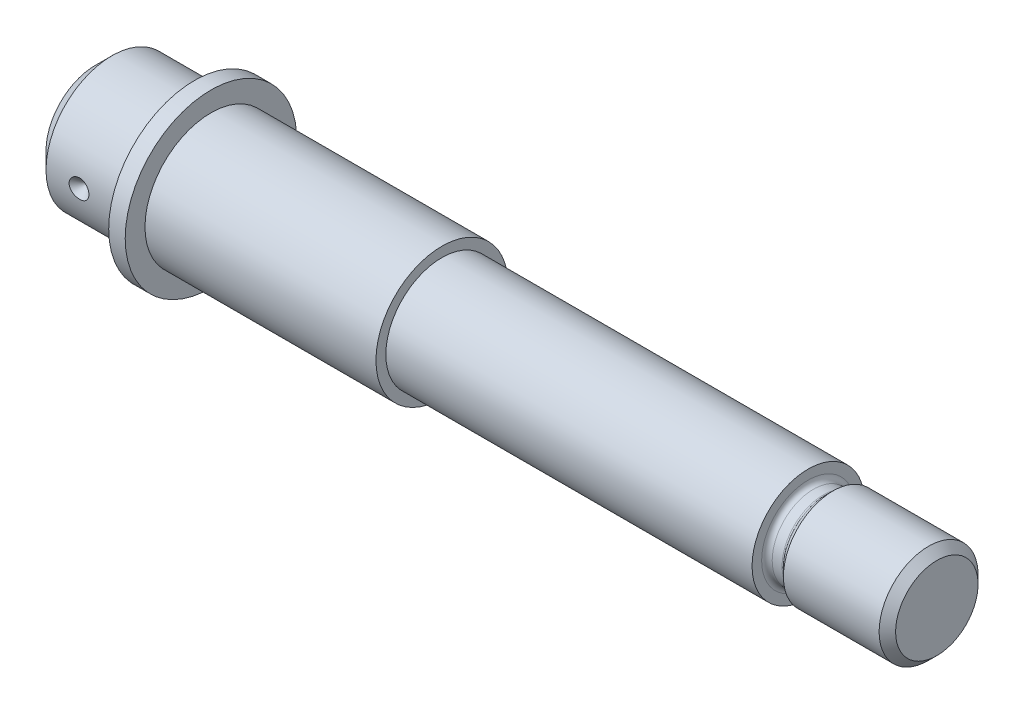
ISO-10303-21;
HEADER;
FILE_DESCRIPTION(('STEP AP214'),'2;1');
FILE_NAME('part.step','',(''),(''),'','','');
FILE_SCHEMA(('AUTOMOTIVE_DESIGN { 1 0 10303 214 1 1 1 1 }'));
ENDSEC;
DATA;
#1=APPLICATION_CONTEXT('core data for automotive mechanical design processes');
#2=APPLICATION_PROTOCOL_DEFINITION('international standard','automotive_design',2000,#1);
#3=PRODUCT_CONTEXT('',#1,'mechanical');
#4=PRODUCT('Part','Part','',(#3));
#5=PRODUCT_RELATED_PRODUCT_CATEGORY('part','',(#4));
#6=PRODUCT_DEFINITION_FORMATION('','',#4);
#7=PRODUCT_DEFINITION_CONTEXT('part definition',#1,'design');
#8=PRODUCT_DEFINITION('design','',#6,#7);
#9=PRODUCT_DEFINITION_SHAPE('','',#8);
#10=(LENGTH_UNIT() NAMED_UNIT(*) SI_UNIT(.MILLI.,.METRE.));
#11=(NAMED_UNIT(*) PLANE_ANGLE_UNIT() SI_UNIT($,.RADIAN.));
#12=(NAMED_UNIT(*) SI_UNIT($,.STERADIAN.) SOLID_ANGLE_UNIT());
#13=UNCERTAINTY_MEASURE_WITH_UNIT(LENGTH_MEASURE(1.E-05),#10,'distance_accuracy_value','');
#14=(GEOMETRIC_REPRESENTATION_CONTEXT(3) GLOBAL_UNCERTAINTY_ASSIGNED_CONTEXT((#13)) GLOBAL_UNIT_ASSIGNED_CONTEXT((#10,
#11,#12)) REPRESENTATION_CONTEXT('',''));
#15=CARTESIAN_POINT('',(0.,0.,0.));
#16=DIRECTION('',(0.,0.,1.));
#17=DIRECTION('',(1.,0.,0.));
#18=AXIS2_PLACEMENT_3D('',#15,#16,#17);
#19=CARTESIAN_POINT('',(-87.7769016299685,0.,0.));
#20=DIRECTION('',(-1.,0.,0.));
#21=DIRECTION('',(0.,0.,1.));
#22=AXIS2_PLACEMENT_3D('',#19,#20,#21);
#23=CYLINDRICAL_SURFACE('',#22,20.);
#24=CARTESIAN_POINT('',(30.,0.,0.));
#25=DIRECTION('',(-1.,0.,0.));
#26=DIRECTION('',(0.,0.,1.));
#27=AXIS2_PLACEMENT_3D('',#24,#25,#26);
#28=CIRCLE('',#27,20.);
#29=CARTESIAN_POINT('',(30.,0.,20.));
#30=VERTEX_POINT('',#29);
#31=EDGE_CURVE('E115',#30,#30,#28,.T.);
#32=ORIENTED_EDGE('',*,*,#31,.T.);
#33=EDGE_LOOP('',(#32));
#34=FACE_BOUND('',#33,.T.);
#35=CARTESIAN_POINT('',(4.99999999999999,0.,0.));
#36=DIRECTION('',(-1.,0.,0.));
#37=DIRECTION('',(0.,0.,1.));
#38=AXIS2_PLACEMENT_3D('',#35,#36,#37);
#39=CIRCLE('',#38,20.);
#40=CARTESIAN_POINT('',(4.99999999999999,0.,20.));
#41=VERTEX_POINT('',#40);
#42=EDGE_CURVE('E112',#41,#41,#39,.T.);
#43=ORIENTED_EDGE('',*,*,#42,.F.);
#44=EDGE_LOOP('',(#43));
#45=FACE_BOUND('',#44,.T.);
#46=CARTESIAN_POINT('',(13.2677829313007,-2.28683354672601,19.8688296727577));
#47=CARTESIAN_POINT('',(13.1496398039185,-2.2086350792218,19.8778294964715));
#48=CARTESIAN_POINT('',(13.0370430962697,-2.12211933772741,19.8873220006394));
#49=CARTESIAN_POINT('',(12.8254604905572,-1.93371358621131,19.9065244997071));
#50=CARTESIAN_POINT('',(12.7264801158722,-1.83181737214252,19.9162345810192));
#51=CARTESIAN_POINT('',(12.5294071238963,-1.59599780385973,19.9366248878203));
#52=CARTESIAN_POINT('',(12.4342668019836,-1.45957043308951,19.9471934001283));
#53=CARTESIAN_POINT('',(12.2700236426961,-1.17165348046068,19.9661710378741));
#54=CARTESIAN_POINT('',(12.2009204426621,-1.02016410843109,19.974580193388));
#55=CARTESIAN_POINT('',(12.0955110663457,-0.717062144500792,19.9876788720925));
#56=CARTESIAN_POINT('',(12.0573630047617,-0.566099303453395,19.9925748676666));
#57=CARTESIAN_POINT('',(12.0083550939979,-0.259765270697412,19.998898570406));
#58=CARTESIAN_POINT('',(11.9974825358207,-0.104396166225387,20.0003278928543));
#59=CARTESIAN_POINT('',(12.003340986111,0.197453876196918,19.9995646758929));
#60=CARTESIAN_POINT('',(12.0186263195033,0.343965624596388,19.9975618155707));
#61=CARTESIAN_POINT('',(12.0734072037141,0.632297343313048,19.9905227924726));
#62=CARTESIAN_POINT('',(12.1129021451476,0.774117431630306,19.9854867060466));
#63=CARTESIAN_POINT('',(12.2145344521342,1.04927980481071,19.9729319630186));
#64=CARTESIAN_POINT('',(12.2766773460547,1.18262001039202,19.9654127003151));
#65=CARTESIAN_POINT('',(12.4213513500154,1.43759803113322,19.948675757663));
#66=CARTESIAN_POINT('',(12.5038864204302,1.55923356673996,19.9394577478885));
#67=CARTESIAN_POINT('',(12.6913437878208,1.79403848781343,19.9197394630019));
#68=CARTESIAN_POINT('',(12.7971879601108,1.90646746130803,19.9091978967065));
#69=CARTESIAN_POINT('',(13.0252108566439,2.11332080900349,19.8883058225313));
#70=CARTESIAN_POINT('',(13.1473944428441,2.20773980378484,19.8779553725674));
#71=CARTESIAN_POINT('',(13.4136011898135,2.38267808679996,19.8577728921582));
#72=CARTESIAN_POINT('',(13.5585465914746,2.46180459061986,19.8480247684175));
#73=CARTESIAN_POINT('',(13.8592639018597,2.59611391848728,19.830904909323));
#74=CARTESIAN_POINT('',(14.0150386419849,2.65129045313665,19.8235337983167));
#75=CARTESIAN_POINT('',(14.341810591719,2.73898096724073,19.8116145154413));
#76=CARTESIAN_POINT('',(14.5131773034119,2.77014525637576,19.807235853734));
#77=CARTESIAN_POINT('',(14.8587583042105,2.8042557215684,19.8024353612554));
#78=CARTESIAN_POINT('',(15.0329730402897,2.80719742490377,19.8020141576631));
#79=CARTESIAN_POINT('',(15.3835953012838,2.78453686648042,19.8052138185109));
#80=CARTESIAN_POINT('',(15.5599594310871,2.75826838049131,19.8089290284758));
#81=CARTESIAN_POINT('',(15.9057187314743,2.67662276479021,19.8201254424472));
#82=CARTESIAN_POINT('',(16.0751134206155,2.62124362776873,19.8276069061522));
#83=CARTESIAN_POINT('',(16.4011514264524,2.48280338350863,19.84541546921));
#84=CARTESIAN_POINT('',(16.5578488399275,2.39986833273168,19.8557295738522));
#85=CARTESIAN_POINT('',(16.8543407011763,2.20799232946235,19.8779792907555));
#86=CARTESIAN_POINT('',(16.9941371629739,2.09905448023824,19.88991470945));
#87=CARTESIAN_POINT('',(17.2472124883284,1.86204473372954,19.9134735159245));
#88=CARTESIAN_POINT('',(17.3612600186916,1.73479501891208,19.9250928264823));
#89=CARTESIAN_POINT('',(17.564556278724,1.46170358772986,19.9469825740195));
#90=CARTESIAN_POINT('',(17.6538166266633,1.31587062864194,19.957253641754));
#91=CARTESIAN_POINT('',(17.7985884571325,1.02012034976051,19.9744787468961));
#92=CARTESIAN_POINT('',(17.8559487967756,0.871118787065797,19.9816078821949));
#93=CARTESIAN_POINT('',(17.9430415027366,0.565143594454445,19.9925981817435));
#94=CARTESIAN_POINT('',(17.9727872814917,0.408173873799948,19.9964609324001));
#95=CARTESIAN_POINT('',(18.0022550750214,0.101726211631031,20.0002902362989));
#96=CARTESIAN_POINT('',(18.0038027305181,-0.0475756110247081,20.000493692664));
#97=CARTESIAN_POINT('',(17.9814690795293,-0.34421458621131,19.9975875168707));
#98=CARTESIAN_POINT('',(17.9575914444647,-0.491552019290443,19.9944783630544));
#99=CARTESIAN_POINT('',(17.8861403003096,-0.777186676649251,19.9853954330868));
#100=CARTESIAN_POINT('',(17.8390357395308,-0.915603864379807,19.9794784325073));
#101=CARTESIAN_POINT('',(17.7231779725514,-1.18291690993242,19.9654362697615));
#102=CARTESIAN_POINT('',(17.6544219224508,-1.31181151422591,19.9573108175366));
#103=CARTESIAN_POINT('',(17.4947372164008,-1.56164565478939,19.9393465080741));
#104=CARTESIAN_POINT('',(17.4030872039217,-1.6821194005691,19.9294556980451));
#105=CARTESIAN_POINT('',(17.202021663394,-1.90712826228652,19.9091851075344));
#106=CARTESIAN_POINT('',(17.0926011241653,-2.01165886618518,19.898805189715));
#107=CARTESIAN_POINT('',(16.8512890497631,-2.20922377373138,19.8778738285179));
#108=CARTESIAN_POINT('',(16.7183852443885,-2.30102540557022,19.8673571627692));
#109=CARTESIAN_POINT('',(16.4396802278035,-2.46255918893201,19.8479832213816));
#110=CARTESIAN_POINT('',(16.2938755195424,-2.53228533285304,19.8391263977176));
#111=CARTESIAN_POINT('',(15.9840075712634,-2.65197983077963,19.8234934164541));
#112=CARTESIAN_POINT('',(15.8193732848476,-2.70049350260946,19.816876018091));
#113=CARTESIAN_POINT('',(15.4843250597363,-2.7704159313433,19.8072220786295));
#114=CARTESIAN_POINT('',(15.3139095378249,-2.79181720086287,19.8041865267128));
#115=CARTESIAN_POINT('',(14.9661049612145,-2.80736419124832,19.8019893632784));
#116=CARTESIAN_POINT('',(14.7886728578765,-2.80057727567529,19.8029603041158));
#117=CARTESIAN_POINT('',(14.4374676021711,-2.75774193078645,19.8089708233951));
#118=CARTESIAN_POINT('',(14.2636934498685,-2.72170160759502,19.8140092747269));
#119=CARTESIAN_POINT('',(13.9479186619506,-2.62798451654796,19.8266380390935));
#120=CARTESIAN_POINT('',(13.804815533264,-2.5739261704327,19.833786952004));
#121=CARTESIAN_POINT('',(13.5282688670032,-2.44538690066802,19.8500447216614));
#122=CARTESIAN_POINT('',(13.3948194596899,-2.37091852108894,19.8591523738233));
#123=CARTESIAN_POINT('',(13.2677829313007,-2.28683354672601,19.8688296727577));
#124=B_SPLINE_CURVE_WITH_KNOTS('',3,(#46,#47,#48,#49,#50,#51,#52,#53,#54,#55,#56,#57,#58,#59,
#60,#61,#62,#63,#64,#65,#66,#67,#68,#69,#70,#71,#72,#73,#74,#75,#76,#77,#78,#79,#80,#81,#82,#83,
#84,#85,#86,#87,#88,#89,#90,#91,#92,#93,#94,#95,#96,#97,#98,#99,#100,#101,#102,#103,#104,#105,
#106,#107,#108,#109,#110,#111,#112,#113,#114,#115,#116,#117,#118,#119,#120,#121,#122,#123),
.UNSPECIFIED.,.T.,.F.,(4,2,2,2,2,2,2,2,2,2,2,2,2,2,2,2,2,2,2,2,2,2,2,2,2,2,2,2,2,2,2,2,2,2,2,2,
2,2,4),(0.,0.4255069269794,0.851185952359957,1.34849776662082,1.84580265379187,2.31074011556554,
2.77546089985683,3.21531904767515,3.65516612418566,4.09512063939807,4.5351606656485,
4.99747929668774,5.45993580266633,5.95402949937522,6.44825286951542,6.96855881296301,
7.48894721326086,8.02145254969016,8.55399460955988,9.0841333106313,9.61420877463305,
10.1253554876597,10.6362622095895,11.1132102333375,11.5899264812706,12.0356603288115,
12.4813298209558,12.9183485869281,13.355424778808,13.8085475047722,14.2617982311572,
14.7452954491403,15.2289241327135,15.7418830104863,16.254983516568,16.7851934365256,
17.3152564853586,17.7730748321335,18.2306124308645),.UNSPECIFIED.);
#125=CARTESIAN_POINT('',(13.2677829313007,-2.28683354672601,19.8688296727577));
#126=VERTEX_POINT('',#125);
#127=EDGE_CURVE('E157',#126,#126,#124,.T.);
#128=ORIENTED_EDGE('',*,*,#127,.T.);
#129=EDGE_LOOP('',(#128));
#130=FACE_BOUND('',#129,.T.);
#131=ADVANCED_FACE('F39',(#34,#45,#130),#23,.T.);
#132=CARTESIAN_POINT('',(255.,0.,12.5));
#133=DIRECTION('',(1.,0.,0.));
#134=DIRECTION('',(0.,0.,-1.));
#135=AXIS2_PLACEMENT_3D('',#132,#133,#134);
#136=PLANE('',#135);
#137=CARTESIAN_POINT('',(255.,0.,0.));
#138=DIRECTION('',(-1.,0.,0.));
#139=DIRECTION('',(0.,0.,1.));
#140=AXIS2_PLACEMENT_3D('',#137,#138,#139);
#141=CIRCLE('',#140,12.5);
#142=CARTESIAN_POINT('',(255.,0.,12.5));
#143=VERTEX_POINT('',#142);
#144=EDGE_CURVE('E154',#143,#143,#141,.T.);
#145=ORIENTED_EDGE('',*,*,#144,.F.);
#146=EDGE_LOOP('',(#145));
#147=FACE_BOUND('',#146,.T.);
#148=ADVANCED_FACE('F41',(#147),#136,.T.);
#149=CARTESIAN_POINT('',(252.5,0.,0.));
#150=DIRECTION('',(-1.,0.,0.));
#151=DIRECTION('',(0.,0.,1.));
#152=AXIS2_PLACEMENT_3D('',#149,#150,#151);
#153=CONICAL_SURFACE('',#152,15.,0.785398163397447);
#154=ORIENTED_EDGE('',*,*,#144,.T.);
#155=EDGE_LOOP('',(#154));
#156=FACE_BOUND('',#155,.T.);
#157=CARTESIAN_POINT('',(252.5,0.,0.));
#158=DIRECTION('',(-1.,0.,0.));
#159=DIRECTION('',(0.,0.,1.));
#160=AXIS2_PLACEMENT_3D('',#157,#158,#159);
#161=CIRCLE('',#160,15.);
#162=CARTESIAN_POINT('',(252.5,0.,15.));
#163=VERTEX_POINT('',#162);
#164=EDGE_CURVE('E151',#163,#163,#161,.T.);
#165=ORIENTED_EDGE('',*,*,#164,.F.);
#166=EDGE_LOOP('',(#165));
#167=FACE_BOUND('',#166,.T.);
#168=ADVANCED_FACE('F201',(#156,#167),#153,.T.);
#169=CARTESIAN_POINT('',(-87.7769016299685,0.,0.));
#170=DIRECTION('',(-1.,0.,0.));
#171=DIRECTION('',(0.,0.,1.));
#172=AXIS2_PLACEMENT_3D('',#169,#170,#171);
#173=CYLINDRICAL_SURFACE('',#172,15.);
#174=ORIENTED_EDGE('',*,*,#164,.T.);
#175=EDGE_LOOP('',(#174));
#176=FACE_BOUND('',#175,.T.);
#177=CARTESIAN_POINT('',(223.5,0.,0.));
#178=DIRECTION('',(-1.,0.,0.));
#179=DIRECTION('',(0.,0.,1.));
#180=AXIS2_PLACEMENT_3D('',#177,#178,#179);
#181=CIRCLE('',#180,15.);
#182=CARTESIAN_POINT('',(223.5,0.,15.));
#183=VERTEX_POINT('',#182);
#184=EDGE_CURVE('E148',#183,#183,#181,.T.);
#185=ORIENTED_EDGE('',*,*,#184,.F.);
#186=EDGE_LOOP('',(#185));
#187=FACE_BOUND('',#186,.T.);
#188=ADVANCED_FACE('F213',(#176,#187),#173,.T.);
#189=CARTESIAN_POINT('',(221.292893218813,0.,0.));
#190=DIRECTION('',(1.,0.,0.));
#191=DIRECTION('',(0.,0.,-1.));
#192=AXIS2_PLACEMENT_3D('',#189,#190,#191);
#193=CONICAL_SURFACE('',#192,12.7928932188139,0.785398163397444);
#194=ORIENTED_EDGE('',*,*,#184,.T.);
#195=EDGE_LOOP('',(#194));
#196=FACE_BOUND('',#195,.T.);
#197=CARTESIAN_POINT('',(221.292893218813,0.,0.));
#198=DIRECTION('',(-1.,0.,0.));
#199=DIRECTION('',(0.,0.,1.));
#200=AXIS2_PLACEMENT_3D('',#197,#198,#199);
#201=CIRCLE('',#200,12.7928932188139);
#202=CARTESIAN_POINT('',(221.292893218813,0.,12.7928932188139));
#203=VERTEX_POINT('',#202);
#204=EDGE_CURVE('E145',#203,#203,#201,.T.);
#205=ORIENTED_EDGE('',*,*,#204,.F.);
#206=EDGE_LOOP('',(#205));
#207=FACE_BOUND('',#206,.T.);
#208=ADVANCED_FACE('F221',(#196,#207),#193,.T.);
#209=CARTESIAN_POINT('',(220.585786437627,0.,0.));
#210=DIRECTION('',(-1.,0.,0.));
#211=DIRECTION('',(0.,0.,1.));
#212=AXIS2_PLACEMENT_3D('',#209,#210,#211);
#213=TOROIDAL_SURFACE('',#212,13.5000000000004,0.999999999999997);
#214=ORIENTED_EDGE('',*,*,#204,.T.);
#215=EDGE_LOOP('',(#214));
#216=FACE_BOUND('',#215,.T.);
#217=CARTESIAN_POINT('',(220.585786437627,0.,0.));
#218=DIRECTION('',(-1.,0.,0.));
#219=DIRECTION('',(0.,0.,1.));
#220=AXIS2_PLACEMENT_3D('',#217,#218,#219);
#221=CIRCLE('',#220,12.5000000000004);
#222=CARTESIAN_POINT('',(220.585786437627,0.,12.5000000000004));
#223=VERTEX_POINT('',#222);
#224=EDGE_CURVE('E142',#223,#223,#221,.T.);
#225=ORIENTED_EDGE('',*,*,#224,.F.);
#226=EDGE_LOOP('',(#225));
#227=FACE_BOUND('',#226,.T.);
#228=ADVANCED_FACE('F227',(#216,#227),#213,.F.);
#229=CARTESIAN_POINT('',(-87.7769016299685,0.,0.));
#230=DIRECTION('',(-1.,0.,0.));
#231=DIRECTION('',(0.,0.,1.));
#232=AXIS2_PLACEMENT_3D('',#229,#230,#231);
#233=CYLINDRICAL_SURFACE('',#232,12.5000000000004);
#234=ORIENTED_EDGE('',*,*,#224,.T.);
#235=EDGE_LOOP('',(#234));
#236=FACE_BOUND('',#235,.T.);
#237=CARTESIAN_POINT('',(217.6,0.,0.));
#238=DIRECTION('',(-1.,0.,0.));
#239=DIRECTION('',(0.,0.,1.));
#240=AXIS2_PLACEMENT_3D('',#237,#238,#239);
#241=CIRCLE('',#240,12.5000000000004);
#242=CARTESIAN_POINT('',(217.6,0.,12.5000000000004));
#243=VERTEX_POINT('',#242);
#244=EDGE_CURVE('E139',#243,#243,#241,.T.);
#245=ORIENTED_EDGE('',*,*,#244,.F.);
#246=EDGE_LOOP('',(#245));
#247=FACE_BOUND('',#246,.T.);
#248=ADVANCED_FACE('F233',(#236,#247),#233,.T.);
#249=CARTESIAN_POINT('',(217.6,0.,0.));
#250=DIRECTION('',(-1.,0.,0.));
#251=DIRECTION('',(0.,0.,1.));
#252=AXIS2_PLACEMENT_3D('',#249,#250,#251);
#253=TOROIDAL_SURFACE('',#252,14.1000000000004,1.6);
#254=ORIENTED_EDGE('',*,*,#244,.T.);
#255=EDGE_LOOP('',(#254));
#256=FACE_BOUND('',#255,.T.);
#257=CARTESIAN_POINT('',(216.,0.,0.));
#258=DIRECTION('',(-1.,0.,0.));
#259=DIRECTION('',(0.,0.,1.));
#260=AXIS2_PLACEMENT_3D('',#257,#258,#259);
#261=CIRCLE('',#260,14.1000000000004);
#262=CARTESIAN_POINT('',(216.,0.,14.1000000000004));
#263=VERTEX_POINT('',#262);
#264=EDGE_CURVE('E136',#263,#263,#261,.T.);
#265=ORIENTED_EDGE('',*,*,#264,.F.);
#266=EDGE_LOOP('',(#265));
#267=FACE_BOUND('',#266,.T.);
#268=ADVANCED_FACE('F239',(#256,#267),#253,.F.);
#269=CARTESIAN_POINT('',(216.,0.,17.));
#270=DIRECTION('',(1.,0.,0.));
#271=DIRECTION('',(0.,0.,-1.));
#272=AXIS2_PLACEMENT_3D('',#269,#270,#271);
#273=PLANE('',#272);
#274=ORIENTED_EDGE('',*,*,#264,.T.);
#275=EDGE_LOOP('',(#274));
#276=FACE_BOUND('',#275,.T.);
#277=CARTESIAN_POINT('',(216.,0.,0.));
#278=DIRECTION('',(-1.,0.,0.));
#279=DIRECTION('',(0.,0.,1.));
#280=AXIS2_PLACEMENT_3D('',#277,#278,#279);
#281=CIRCLE('',#280,17.);
#282=CARTESIAN_POINT('',(216.,0.,17.));
#283=VERTEX_POINT('',#282);
#284=EDGE_CURVE('E133',#283,#283,#281,.T.);
#285=ORIENTED_EDGE('',*,*,#284,.F.);
#286=EDGE_LOOP('',(#285));
#287=FACE_BOUND('',#286,.T.);
#288=ADVANCED_FACE('F245',(#276,#287),#273,.T.);
#289=CARTESIAN_POINT('',(-87.7769016299685,0.,0.));
#290=DIRECTION('',(-1.,0.,0.));
#291=DIRECTION('',(0.,0.,1.));
#292=AXIS2_PLACEMENT_3D('',#289,#290,#291);
#293=CYLINDRICAL_SURFACE('',#292,17.);
#294=ORIENTED_EDGE('',*,*,#284,.T.);
#295=EDGE_LOOP('',(#294));
#296=FACE_BOUND('',#295,.T.);
#297=CARTESIAN_POINT('',(105.,0.,0.));
#298=DIRECTION('',(-1.,0.,0.));
#299=DIRECTION('',(0.,0.,1.));
#300=AXIS2_PLACEMENT_3D('',#297,#298,#299);
#301=CIRCLE('',#300,17.);
#302=CARTESIAN_POINT('',(105.,0.,17.));
#303=VERTEX_POINT('',#302);
#304=EDGE_CURVE('E130',#303,#303,#301,.T.);
#305=ORIENTED_EDGE('',*,*,#304,.F.);
#306=EDGE_LOOP('',(#305));
#307=FACE_BOUND('',#306,.T.);
#308=ADVANCED_FACE('F251',(#296,#307),#293,.T.);
#309=CARTESIAN_POINT('',(105.,0.,20.));
#310=DIRECTION('',(1.,0.,0.));
#311=DIRECTION('',(0.,0.,-1.));
#312=AXIS2_PLACEMENT_3D('',#309,#310,#311);
#313=PLANE('',#312);
#314=ORIENTED_EDGE('',*,*,#304,.T.);
#315=EDGE_LOOP('',(#314));
#316=FACE_BOUND('',#315,.T.);
#317=CARTESIAN_POINT('',(105.,0.,0.));
#318=DIRECTION('',(-1.,0.,0.));
#319=DIRECTION('',(0.,0.,1.));
#320=AXIS2_PLACEMENT_3D('',#317,#318,#319);
#321=CIRCLE('',#320,20.);
#322=CARTESIAN_POINT('',(105.,0.,20.));
#323=VERTEX_POINT('',#322);
#324=EDGE_CURVE('E127',#323,#323,#321,.T.);
#325=ORIENTED_EDGE('',*,*,#324,.F.);
#326=EDGE_LOOP('',(#325));
#327=FACE_BOUND('',#326,.T.);
#328=ADVANCED_FACE('F257',(#316,#327),#313,.T.);
#329=CARTESIAN_POINT('',(-87.7769016299685,0.,0.));
#330=DIRECTION('',(-1.,0.,0.));
#331=DIRECTION('',(0.,0.,1.));
#332=AXIS2_PLACEMENT_3D('',#329,#330,#331);
#333=CYLINDRICAL_SURFACE('',#332,20.);
#334=CARTESIAN_POINT('',(53.,-6.,-19.0787840283389));
#335=CARTESIAN_POINT('',(52.8353320050892,-6.00002230630954,-19.0787603919218));
#336=CARTESIAN_POINT('',(52.6706726130696,-5.99322212828861,-19.0809150948054));
#337=CARTESIAN_POINT('',(52.3426105716154,-5.96614198358439,-19.089408588524));
#338=CARTESIAN_POINT('',(52.1792076479863,-5.94586504749983,-19.0957464386677));
#339=CARTESIAN_POINT('',(51.8552332063158,-5.89206455668659,-19.1124126760415));
#340=CARTESIAN_POINT('',(51.6946555720362,-5.85857463708937,-19.1227309292375));
#341=CARTESIAN_POINT('',(51.3770376913315,-5.77865096251378,-19.1470349488515));
#342=CARTESIAN_POINT('',(51.2199975375307,-5.73221686903431,-19.1610208111801));
#343=CARTESIAN_POINT('',(50.9106174392765,-5.62682620459484,-19.1922338155173));
#344=CARTESIAN_POINT('',(50.7582747812241,-5.56787702452553,-19.2094590438083));
#345=CARTESIAN_POINT('',(50.4591258570984,-5.43788252899625,-19.2466621419291));
#346=CARTESIAN_POINT('',(50.312321675672,-5.36683271334057,-19.2666410353108));
#347=CARTESIAN_POINT('',(50.0252150547469,-5.21317247195195,-19.3087849542851));
#348=CARTESIAN_POINT('',(49.8849129814703,-5.13056139609832,-19.3309501027959));
#349=CARTESIAN_POINT('',(49.6116122013252,-4.95431913401973,-19.3768680311909));
#350=CARTESIAN_POINT('',(49.4786162831278,-4.86068378223771,-19.4006214097184));
#351=CARTESIAN_POINT('',(49.2171364267704,-4.66024014290223,-19.4497584548899));
#352=CARTESIAN_POINT('',(49.0888848478018,-4.5531352636269,-19.4751691904069));
#353=CARTESIAN_POINT('',(48.8417460629913,-4.32860344600266,-19.5263015189751));
#354=CARTESIAN_POINT('',(48.7228621333289,-4.21117292654718,-19.5520232171847));
#355=CARTESIAN_POINT('',(48.4952586048781,-3.96676059198592,-19.6030710031715));
#356=CARTESIAN_POINT('',(48.3865390679712,-3.83977871873938,-19.6283970885393));
#357=CARTESIAN_POINT('',(48.1799807455275,-3.57705696576211,-19.6779706962222));
#358=CARTESIAN_POINT('',(48.0821418741611,-3.44131715512969,-19.7022182270443));
#359=CARTESIAN_POINT('',(47.8960902317401,-3.15899953964077,-19.7494715734221));
#360=CARTESIAN_POINT('',(47.8081219536976,-3.01225429870654,-19.7724407517412));
#361=CARTESIAN_POINT('',(47.6449362059451,-2.71155717798052,-19.8159158974823));
#362=CARTESIAN_POINT('',(47.569714021433,-2.55760798995096,-19.8364227748921));
#363=CARTESIAN_POINT('',(47.4325835606286,-2.24348996032481,-19.8744001644265));
#364=CARTESIAN_POINT('',(47.3706777452318,-2.08331997555618,-19.8918701152059));
#365=CARTESIAN_POINT('',(47.2607624975442,-1.75801430484773,-19.923254535561));
#366=CARTESIAN_POINT('',(47.2127470600318,-1.59288079897389,-19.9371705413066));
#367=CARTESIAN_POINT('',(47.1321744532723,-1.26354510595574,-19.960709769643));
#368=CARTESIAN_POINT('',(47.0992193730418,-1.09944808925078,-19.9704430293701));
#369=CARTESIAN_POINT('',(47.0471280027136,-0.768952154148948,-19.9858966495547));
#370=CARTESIAN_POINT('',(47.0279861958654,-0.602554181799294,-19.9916186120195));
#371=CARTESIAN_POINT('',(47.0036800351432,-0.268644299740229,-19.9988929276978));
#372=CARTESIAN_POINT('',(46.9985161056939,-0.101132356360975,-20.0004451543012));
#373=CARTESIAN_POINT('',(47.0022164050785,0.23372090041086,-19.9993350985709));
#374=CARTESIAN_POINT('',(47.0110803764628,0.401062216878503,-19.9966728935831));
#375=CARTESIAN_POINT('',(47.0422422116024,0.728949940400309,-19.9873626800314));
#376=CARTESIAN_POINT('',(47.0641000099828,0.889542117296655,-19.9808452710305));
#377=CARTESIAN_POINT('',(47.1206954817584,1.20830021014906,-19.9641050678088));
#378=CARTESIAN_POINT('',(47.1554375422251,1.36646528055415,-19.9538810115069));
#379=CARTESIAN_POINT('',(47.2374923016098,1.67917461818938,-19.9300014175933));
#380=CARTESIAN_POINT('',(47.2848007757229,1.83372008335732,-19.916347033335));
#381=CARTESIAN_POINT('',(47.3916302710632,2.13828018933735,-19.885954581515));
#382=CARTESIAN_POINT('',(47.4511558839967,2.2882931022387,-19.8692153547843));
#383=CARTESIAN_POINT('',(47.5826905795394,2.58443507880942,-19.8328818557961));
#384=CARTESIAN_POINT('',(47.6548328971983,2.7305012482212,-19.8132575095082));
#385=CARTESIAN_POINT('',(47.8106231473295,3.01609632375421,-19.7717979578185));
#386=CARTESIAN_POINT('',(47.8942750283842,3.15562296424241,-19.7499619943591));
#387=CARTESIAN_POINT('',(48.0724869824413,3.42724384686892,-19.704643118031));
#388=CARTESIAN_POINT('',(48.1670471814283,3.55933800314027,-19.681160186142));
#389=CARTESIAN_POINT('',(48.3664586784288,3.81531376455356,-19.6331439703208));
#390=CARTESIAN_POINT('',(48.4713102765009,3.93919513006484,-19.6086106557752));
#391=CARTESIAN_POINT('',(48.6948972434632,4.18263653591652,-19.5581593507452));
#392=CARTESIAN_POINT('',(48.8140126794743,4.30184428600934,-19.5322244988475));
#393=CARTESIAN_POINT('',(49.0618335035024,4.52981041510268,-19.4806179410542));
#394=CARTESIAN_POINT('',(49.1905357960809,4.63857214120815,-19.454946153239));
#395=CARTESIAN_POINT('',(49.4568403962385,4.84504126060965,-19.4045581786367));
#396=CARTESIAN_POINT('',(49.5944485719006,4.94274124635233,-19.3798426394128));
#397=CARTESIAN_POINT('',(49.8775590923328,5.12628631686324,-19.3321023379674));
#398=CARTESIAN_POINT('',(50.0230583375784,5.21213600998877,-19.3090769201297));
#399=CARTESIAN_POINT('',(50.3226351350932,5.37223080367566,-19.2651525602885));
#400=CARTESIAN_POINT('',(50.4767870786591,5.44634371437402,-19.2442786555291));
#401=CARTESIAN_POINT('',(50.7911218413611,5.58122691640504,-19.2055937237889));
#402=CARTESIAN_POINT('',(50.9513021624776,5.64200266456204,-19.1877814448102));
#403=CARTESIAN_POINT('',(51.27643211835,5.74966145349631,-19.1557967477957));
#404=CARTESIAN_POINT('',(51.4413765265629,5.79655912825488,-19.1416204978023));
#405=CARTESIAN_POINT('',(51.774893180451,5.87609462586438,-19.1173543231182));
#406=CARTESIAN_POINT('',(51.9434637150485,5.90873902604377,-19.1072625137754));
#407=CARTESIAN_POINT('',(52.2599370702365,5.95603131732401,-19.0925703406668));
#408=CARTESIAN_POINT('',(52.40754170936,5.97251971262425,-19.0874107715083));
#409=CARTESIAN_POINT('',(52.7034271124753,5.99450261914156,-19.0805126306352));
#410=CARTESIAN_POINT('',(52.8517065595747,6.00001329545508,-19.0787690288453));
#411=CARTESIAN_POINT('',(53.,6.,-19.0787840283389));
#412=B_SPLINE_CURVE_WITH_KNOTS('',3,(#334,#335,#336,#337,#338,#339,#340,#341,#342,#343,#344,
#345,#346,#347,#348,#349,#350,#351,#352,#353,#354,#355,#356,#357,#358,#359,#360,#361,#362,#363,
#364,#365,#366,#367,#368,#369,#370,#371,#372,#373,#374,#375,#376,#377,#378,#379,#380,#381,#382,
#383,#384,#385,#386,#387,#388,#389,#390,#391,#392,#393,#394,#395,#396,#397,#398,#399,#400,#401,
#402,#403,#404,#405,#406,#407,#408,#409,#410,#411),.UNSPECIFIED.,.F.,.F.,(4,2,2,2,2,2,2,2,2,2,2,
2,2,2,2,2,2,2,2,2,2,2,2,2,2,2,2,2,2,2,2,2,2,2,2,2,2,2,4),(0.,0.493836284878934,
0.987561555412174,1.48003801924603,1.97252736296405,2.46472666795181,2.95710942192587,
3.44951987503684,3.94211698773001,4.44857898474592,4.95521732942467,5.46185875834846,
5.96849619046395,6.48574341264194,7.00279888450885,7.5199498274806,8.03687685551445,
8.53921958328379,9.04136157401789,9.54351881163821,10.0456668334346,10.531706521874,
11.0179118582603,11.5039539397551,11.9901790315928,12.4818885441265,12.9737671698834,
13.4656514771114,13.9575501300996,14.4684682486943,14.9792221093922,15.4903160010787,
16.001210574562,16.5175029344931,17.0335836608614,17.5491182415751,18.0644146711719,
18.509813123396,18.9545552237083),.UNSPECIFIED.);
#413=CARTESIAN_POINT('',(53.,-6.,-19.0787840283389));
#414=VERTEX_POINT('',#413);
#415=CARTESIAN_POINT('',(53.,6.,-19.0787840283389));
#416=VERTEX_POINT('',#415);
#417=EDGE_CURVE('E165',#414,#416,#412,.T.);
#418=ORIENTED_EDGE('',*,*,#417,.F.);
#419=DIRECTION('',(-1.,0.,0.));
#420=VECTOR('',#419,1.);
#421=CARTESIAN_POINT('',(-87.7769016299685,-6.,-19.0787840283389));
#422=LINE('',#421,#420);
#423=CARTESIAN_POINT('',(73.,-6.,-19.0787840283389));
#424=VERTEX_POINT('',#423);
#425=EDGE_CURVE('E11',#424,#414,#422,.T.);
#426=ORIENTED_EDGE('',*,*,#425,.F.);
#427=CARTESIAN_POINT('',(73.,6.,-19.0787840283389));
#428=CARTESIAN_POINT('',(73.1646679949108,6.00002230630954,-19.0787603919218));
#429=CARTESIAN_POINT('',(73.3293273869304,5.99322212828861,-19.0809150948054));
#430=CARTESIAN_POINT('',(73.6573894283846,5.96614198358439,-19.089408588524));
#431=CARTESIAN_POINT('',(73.8207923520137,5.94586504749983,-19.0957464386677));
#432=CARTESIAN_POINT('',(74.1447667936842,5.89206455668659,-19.1124126760415));
#433=CARTESIAN_POINT('',(74.3053444279638,5.85857463708937,-19.1227309292375));
#434=CARTESIAN_POINT('',(74.6229623086685,5.77865096251378,-19.1470349488515));
#435=CARTESIAN_POINT('',(74.7800024624693,5.73221686903431,-19.1610208111801));
#436=CARTESIAN_POINT('',(75.0893825607235,5.62682620459484,-19.1922338155173));
#437=CARTESIAN_POINT('',(75.2417252187759,5.56787702452553,-19.2094590438083));
#438=CARTESIAN_POINT('',(75.5408741429016,5.43788252899625,-19.2466621419291));
#439=CARTESIAN_POINT('',(75.6876783243281,5.36683271334057,-19.2666410353108));
#440=CARTESIAN_POINT('',(75.9747849452531,5.21317247195195,-19.3087849542851));
#441=CARTESIAN_POINT('',(76.1150870185297,5.13056139609832,-19.3309501027959));
#442=CARTESIAN_POINT('',(76.3883877986748,4.95431913401972,-19.3768680311909));
#443=CARTESIAN_POINT('',(76.5213837168723,4.8606837822377,-19.4006214097184));
#444=CARTESIAN_POINT('',(76.7828635732296,4.66024014290222,-19.4497584548899));
#445=CARTESIAN_POINT('',(76.9111151521982,4.55313526362689,-19.4751691904069));
#446=CARTESIAN_POINT('',(77.1582539370087,4.32860344600265,-19.5263015189751));
#447=CARTESIAN_POINT('',(77.2771378666712,4.21117292654718,-19.5520232171847));
#448=CARTESIAN_POINT('',(77.5047413951219,3.96676059198591,-19.6030710031715));
#449=CARTESIAN_POINT('',(77.6134609320288,3.83977871873938,-19.6283970885393));
#450=CARTESIAN_POINT('',(77.8200192544725,3.57705696576209,-19.6779706962222));
#451=CARTESIAN_POINT('',(77.917858125839,3.44131715512967,-19.7022182270443));
#452=CARTESIAN_POINT('',(78.1039097682599,3.15899953964075,-19.7494715734221));
#453=CARTESIAN_POINT('',(78.1918780463025,3.01225429870652,-19.7724407517412));
#454=CARTESIAN_POINT('',(78.355063794055,2.71155717798051,-19.8159158974823));
#455=CARTESIAN_POINT('',(78.430285978567,2.55760798995095,-19.8364227748921));
#456=CARTESIAN_POINT('',(78.5674164393715,2.24348996032481,-19.8744001644265));
#457=CARTESIAN_POINT('',(78.6293222547682,2.08331997555618,-19.8918701152059));
#458=CARTESIAN_POINT('',(78.7392375024558,1.75801430484772,-19.923254535561));
#459=CARTESIAN_POINT('',(78.7872529399682,1.59288079897388,-19.9371705413066));
#460=CARTESIAN_POINT('',(78.8678255467277,1.26354510595574,-19.960709769643));
#461=CARTESIAN_POINT('',(78.9007806269582,1.09944808925078,-19.9704430293701));
#462=CARTESIAN_POINT('',(78.9528719972864,0.768952154148945,-19.9858966495547));
#463=CARTESIAN_POINT('',(78.9720138041346,0.60255418179929,-19.9916186120195));
#464=CARTESIAN_POINT('',(78.9963199648569,0.268644299740225,-19.9988929276978));
#465=CARTESIAN_POINT('',(79.0014838943061,0.101132356360971,-20.0004451543012));
#466=CARTESIAN_POINT('',(78.9977835949215,-0.233720900410864,-19.9993350985709));
#467=CARTESIAN_POINT('',(78.9889196235372,-0.401062216878506,-19.9966728935831));
#468=CARTESIAN_POINT('',(78.9577577883976,-0.728949940400313,-19.9873626800314));
#469=CARTESIAN_POINT('',(78.9358999900173,-0.88954211729666,-19.9808452710305));
#470=CARTESIAN_POINT('',(78.8793045182417,-1.20830021014907,-19.9641050678088));
#471=CARTESIAN_POINT('',(78.8445624577749,-1.36646528055415,-19.9538810115069));
#472=CARTESIAN_POINT('',(78.7625076983902,-1.67917461818938,-19.9300014175933));
#473=CARTESIAN_POINT('',(78.7151992242771,-1.83372008335732,-19.916347033335));
#474=CARTESIAN_POINT('',(78.6083697289368,-2.13828018933735,-19.885954581515));
#475=CARTESIAN_POINT('',(78.5488441160033,-2.28829310223871,-19.8692153547843));
#476=CARTESIAN_POINT('',(78.4173094204607,-2.58443507880942,-19.8328818557961));
#477=CARTESIAN_POINT('',(78.3451671028017,-2.73050124822121,-19.8132575095082));
#478=CARTESIAN_POINT('',(78.1893768526705,-3.01609632375421,-19.7717979578185));
#479=CARTESIAN_POINT('',(78.1057249716159,-3.15562296424242,-19.7499619943591));
#480=CARTESIAN_POINT('',(77.9275130175587,-3.42724384686892,-19.704643118031));
#481=CARTESIAN_POINT('',(77.8329528185717,-3.55933800314028,-19.681160186142));
#482=CARTESIAN_POINT('',(77.6335413215712,-3.81531376455357,-19.6331439703208));
#483=CARTESIAN_POINT('',(77.5286897234991,-3.93919513006485,-19.6086106557752));
#484=CARTESIAN_POINT('',(77.3051027565368,-4.18263653591652,-19.5581593507452));
#485=CARTESIAN_POINT('',(77.1859873205257,-4.30184428600934,-19.5322244988475));
#486=CARTESIAN_POINT('',(76.9381664964976,-4.52981041510267,-19.4806179410542));
#487=CARTESIAN_POINT('',(76.8094642039191,-4.63857214120816,-19.454946153239));
#488=CARTESIAN_POINT('',(76.5431596037615,-4.84504126060966,-19.4045581786367));
#489=CARTESIAN_POINT('',(76.4055514280994,-4.94274124635233,-19.3798426394128));
#490=CARTESIAN_POINT('',(76.1224409076672,-5.12628631686324,-19.3321023379674));
#491=CARTESIAN_POINT('',(75.9769416624216,-5.21213600998877,-19.3090769201297));
#492=CARTESIAN_POINT('',(75.6773648649068,-5.37223080367566,-19.2651525602885));
#493=CARTESIAN_POINT('',(75.523212921341,-5.44634371437402,-19.2442786555291));
#494=CARTESIAN_POINT('',(75.2088781586389,-5.58122691640503,-19.2055937237889));
#495=CARTESIAN_POINT('',(75.0486978375224,-5.64200266456203,-19.1877814448102));
#496=CARTESIAN_POINT('',(74.7235678816501,-5.74966145349631,-19.1557967477957));
#497=CARTESIAN_POINT('',(74.5586234734372,-5.79655912825487,-19.1416204978023));
#498=CARTESIAN_POINT('',(74.225106819549,-5.87609462586438,-19.1173543231182));
#499=CARTESIAN_POINT('',(74.0565362849515,-5.90873902604377,-19.1072625137754));
#500=CARTESIAN_POINT('',(73.7400629297635,-5.95603131732401,-19.0925703406668));
#501=CARTESIAN_POINT('',(73.59245829064,-5.97251971262425,-19.0874107715083));
#502=CARTESIAN_POINT('',(73.2965728875247,-5.99450261914156,-19.0805126306352));
#503=CARTESIAN_POINT('',(73.1482934404253,-6.00001329545509,-19.0787690288453));
#504=CARTESIAN_POINT('',(73.,-6.,-19.0787840283389));
#505=B_SPLINE_CURVE_WITH_KNOTS('',3,(#427,#428,#429,#430,#431,#432,#433,#434,#435,#436,#437,
#438,#439,#440,#441,#442,#443,#444,#445,#446,#447,#448,#449,#450,#451,#452,#453,#454,#455,#456,
#457,#458,#459,#460,#461,#462,#463,#464,#465,#466,#467,#468,#469,#470,#471,#472,#473,#474,#475,
#476,#477,#478,#479,#480,#481,#482,#483,#484,#485,#486,#487,#488,#489,#490,#491,#492,#493,#494,
#495,#496,#497,#498,#499,#500,#501,#502,#503,#504),.UNSPECIFIED.,.F.,.F.,(4,2,2,2,2,2,2,2,2,2,2,
2,2,2,2,2,2,2,2,2,2,2,2,2,2,2,2,2,2,2,2,2,2,2,2,2,2,2,4),(0.,0.493836284878934,
0.987561555412188,1.48003801924603,1.97252736296405,2.4647266679518,2.95710942192587,
3.44951987503684,3.94211698773002,4.44857898474594,4.95521732942468,5.46185875834848,
5.96849619046397,6.48574341264195,7.00279888450886,7.5199498274806,8.03687685551445,
8.53921958328379,9.0413615740179,9.54351881163821,10.0456668334346,10.531706521874,
11.0179118582603,11.5039539397552,11.9901790315928,12.4818885441265,12.9737671698834,
13.4656514771114,13.9575501300996,14.4684682486943,14.9792221093922,15.4903160010787,
16.001210574562,16.517502934493,17.0335836608614,17.549118241575,18.0644146711719,
18.509813123396,18.9545552237083),.UNSPECIFIED.);
#506=CARTESIAN_POINT('',(73.,6.,-19.0787840283389));
#507=VERTEX_POINT('',#506);
#508=EDGE_CURVE('E47',#507,#424,#505,.T.);
#509=ORIENTED_EDGE('',*,*,#508,.F.);
#510=DIRECTION('',(-1.,0.,0.));
#511=VECTOR('',#510,1.);
#512=CARTESIAN_POINT('',(-87.7769016299685,6.,-19.0787840283389));
#513=LINE('',#512,#511);
#514=EDGE_CURVE('E290',#416,#507,#513,.F.);
#515=ORIENTED_EDGE('',*,*,#514,.F.);
#516=EDGE_LOOP('',(#418,#426,#509,#515));
#517=FACE_BOUND('',#516,.T.);
#518=ORIENTED_EDGE('',*,*,#324,.T.);
#519=EDGE_LOOP('',(#518));
#520=FACE_BOUND('',#519,.T.);
#521=CARTESIAN_POINT('',(35.,0.,0.));
#522=DIRECTION('',(-1.,0.,0.));
#523=DIRECTION('',(0.,0.,1.));
#524=AXIS2_PLACEMENT_3D('',#521,#522,#523);
#525=CIRCLE('',#524,20.);
#526=CARTESIAN_POINT('',(35.,0.,20.));
#527=VERTEX_POINT('',#526);
#528=EDGE_CURVE('E124',#527,#527,#525,.T.);
#529=ORIENTED_EDGE('',*,*,#528,.F.);
#530=EDGE_LOOP('',(#529));
#531=FACE_BOUND('',#530,.T.);
#532=ADVANCED_FACE('F263',(#517,#520,#531),#333,.T.);
#533=CARTESIAN_POINT('',(35.,0.,26.));
#534=DIRECTION('',(1.,0.,0.));
#535=DIRECTION('',(0.,0.,-1.));
#536=AXIS2_PLACEMENT_3D('',#533,#534,#535);
#537=PLANE('',#536);
#538=ORIENTED_EDGE('',*,*,#528,.T.);
#539=EDGE_LOOP('',(#538));
#540=FACE_BOUND('',#539,.T.);
#541=CARTESIAN_POINT('',(35.,0.,0.));
#542=DIRECTION('',(-1.,0.,0.));
#543=DIRECTION('',(0.,0.,1.));
#544=AXIS2_PLACEMENT_3D('',#541,#542,#543);
#545=CIRCLE('',#544,26.);
#546=CARTESIAN_POINT('',(35.,0.,26.));
#547=VERTEX_POINT('',#546);
#548=EDGE_CURVE('E121',#547,#547,#545,.T.);
#549=ORIENTED_EDGE('',*,*,#548,.F.);
#550=EDGE_LOOP('',(#549));
#551=FACE_BOUND('',#550,.T.);
#552=ADVANCED_FACE('F269',(#540,#551),#537,.T.);
#553=CARTESIAN_POINT('',(-87.7769016299685,0.,0.));
#554=DIRECTION('',(-1.,0.,0.));
#555=DIRECTION('',(0.,0.,1.));
#556=AXIS2_PLACEMENT_3D('',#553,#554,#555);
#557=CYLINDRICAL_SURFACE('',#556,26.);
#558=ORIENTED_EDGE('',*,*,#548,.T.);
#559=EDGE_LOOP('',(#558));
#560=FACE_BOUND('',#559,.T.);
#561=CARTESIAN_POINT('',(30.,0.,0.));
#562=DIRECTION('',(-1.,0.,0.));
#563=DIRECTION('',(0.,0.,1.));
#564=AXIS2_PLACEMENT_3D('',#561,#562,#563);
#565=CIRCLE('',#564,26.);
#566=CARTESIAN_POINT('',(30.,0.,26.));
#567=VERTEX_POINT('',#566);
#568=EDGE_CURVE('E118',#567,#567,#565,.T.);
#569=ORIENTED_EDGE('',*,*,#568,.F.);
#570=EDGE_LOOP('',(#569));
#571=FACE_BOUND('',#570,.T.);
#572=ADVANCED_FACE('F193',(#560,#571),#557,.T.);
#573=CARTESIAN_POINT('',(30.,0.,20.));
#574=DIRECTION('',(-1.,0.,0.));
#575=DIRECTION('',(0.,0.,1.));
#576=AXIS2_PLACEMENT_3D('',#573,#574,#575);
#577=PLANE('',#576);
#578=ORIENTED_EDGE('',*,*,#568,.T.);
#579=EDGE_LOOP('',(#578));
#580=FACE_BOUND('',#579,.T.);
#581=ORIENTED_EDGE('',*,*,#31,.F.);
#582=EDGE_LOOP('',(#581));
#583=FACE_BOUND('',#582,.T.);
#584=ADVANCED_FACE('F188',(#580,#583),#577,.T.);
#585=CARTESIAN_POINT('',(0.,0.,0.));
#586=DIRECTION('',(1.,0.,0.));
#587=DIRECTION('',(0.,0.,-1.));
#588=AXIS2_PLACEMENT_3D('',#585,#586,#587);
#589=CONICAL_SURFACE('',#588,15.,0.785398163397449);
#590=ORIENTED_EDGE('',*,*,#42,.T.);
#591=EDGE_LOOP('',(#590));
#592=FACE_BOUND('',#591,.T.);
#593=CARTESIAN_POINT('',(0.,0.,0.));
#594=DIRECTION('',(-1.,0.,0.));
#595=DIRECTION('',(0.,0.,1.));
#596=AXIS2_PLACEMENT_3D('',#593,#594,#595);
#597=CIRCLE('',#596,15.);
#598=CARTESIAN_POINT('',(0.,0.,15.));
#599=VERTEX_POINT('',#598);
#600=EDGE_CURVE('E105',#599,#599,#597,.T.);
#601=ORIENTED_EDGE('',*,*,#600,.F.);
#602=EDGE_LOOP('',(#601));
#603=FACE_BOUND('',#602,.T.);
#604=ADVANCED_FACE('F185',(#592,#603),#589,.T.);
#605=CARTESIAN_POINT('',(0.,0.,0.));
#606=DIRECTION('',(-1.,0.,0.));
#607=DIRECTION('',(0.,0.,1.));
#608=AXIS2_PLACEMENT_3D('',#605,#606,#607);
#609=PLANE('',#608);
#610=ORIENTED_EDGE('',*,*,#600,.T.);
#611=EDGE_LOOP('',(#610));
#612=FACE_BOUND('',#611,.T.);
#613=ADVANCED_FACE('F181',(#612),#609,.T.);
#614=CARTESIAN_POINT('',(15.,0.,20.));
#615=DIRECTION('',(0.,0.,1.));
#616=DIRECTION('',(1.,0.,0.));
#617=AXIS2_PLACEMENT_3D('',#614,#615,#616);
#618=CONICAL_SURFACE('',#617,3.,0.785398163397443);
#619=CARTESIAN_POINT('',(15.,0.,17.));
#620=VERTEX_POINT('',#619);
#621=VERTEX_LOOP('',#620);
#622=FACE_BOUND('',#621,.T.);
#623=ORIENTED_EDGE('',*,*,#127,.F.);
#624=EDGE_LOOP('',(#623));
#625=FACE_BOUND('',#624,.T.);
#626=ADVANCED_FACE('F176',(#622,#625),#618,.F.);
#627=CARTESIAN_POINT('',(73.,0.,-16.));
#628=DIRECTION('',(0.,0.,-1.));
#629=DIRECTION('',(-1.,0.,0.));
#630=AXIS2_PLACEMENT_3D('',#627,#628,#629);
#631=CYLINDRICAL_SURFACE('',#630,6.);
#632=DIRECTION('',(0.,0.,-1.));
#633=VECTOR('',#632,1.);
#634=CARTESIAN_POINT('',(73.,6.,-16.));
#635=LINE('',#634,#633);
#636=CARTESIAN_POINT('',(73.,6.,-16.));
#637=VERTEX_POINT('',#636);
#638=EDGE_CURVE('E103',#637,#507,#635,.T.);
#639=ORIENTED_EDGE('',*,*,#638,.T.);
#640=ORIENTED_EDGE('',*,*,#508,.T.);
#641=DIRECTION('',(0.,0.,-1.));
#642=VECTOR('',#641,1.);
#643=CARTESIAN_POINT('',(73.,-6.,-16.));
#644=LINE('',#643,#642);
#645=CARTESIAN_POINT('',(73.,-6.,-16.));
#646=VERTEX_POINT('',#645);
#647=EDGE_CURVE('E53',#646,#424,#644,.T.);
#648=ORIENTED_EDGE('',*,*,#647,.F.);
#649=CARTESIAN_POINT('',(73.,0.,-16.));
#650=DIRECTION('',(0.,0.,-1.));
#651=DIRECTION('',(-1.,0.,0.));
#652=AXIS2_PLACEMENT_3D('',#649,#650,#651);
#653=CIRCLE('',#652,6.);
#654=EDGE_CURVE('E82',#637,#646,#653,.T.);
#655=ORIENTED_EDGE('',*,*,#654,.F.);
#656=EDGE_LOOP('',(#639,#640,#648,#655));
#657=FACE_BOUND('',#656,.T.);
#658=ADVANCED_FACE('F80',(#657),#631,.F.);
#659=CARTESIAN_POINT('',(73.,6.,-16.));
#660=DIRECTION('',(0.,1.,0.));
#661=DIRECTION('',(0.,0.,1.));
#662=AXIS2_PLACEMENT_3D('',#659,#660,#661);
#663=PLANE('',#662);
#664=ORIENTED_EDGE('',*,*,#514,.T.);
#665=ORIENTED_EDGE('',*,*,#638,.F.);
#666=DIRECTION('',(1.,0.,0.));
#667=VECTOR('',#666,1.);
#668=CARTESIAN_POINT('',(73.,6.,-16.));
#669=LINE('',#668,#667);
#670=CARTESIAN_POINT('',(53.,6.,-16.));
#671=VERTEX_POINT('',#670);
#672=EDGE_CURVE('E86',#671,#637,#669,.T.);
#673=ORIENTED_EDGE('',*,*,#672,.F.);
#674=DIRECTION('',(0.,0.,-1.));
#675=VECTOR('',#674,1.);
#676=CARTESIAN_POINT('',(53.,6.,-16.));
#677=LINE('',#676,#675);
#678=EDGE_CURVE('E106',#671,#416,#677,.T.);
#679=ORIENTED_EDGE('',*,*,#678,.T.);
#680=EDGE_LOOP('',(#664,#665,#673,#679));
#681=FACE_BOUND('',#680,.T.);
#682=ADVANCED_FACE('F296',(#681),#663,.F.);
#683=CARTESIAN_POINT('',(53.,0.,-16.));
#684=DIRECTION('',(0.,0.,-1.));
#685=DIRECTION('',(-1.,0.,0.));
#686=AXIS2_PLACEMENT_3D('',#683,#684,#685);
#687=CYLINDRICAL_SURFACE('',#686,6.);
#688=DIRECTION('',(0.,0.,-1.));
#689=VECTOR('',#688,1.);
#690=CARTESIAN_POINT('',(53.,-6.,-16.));
#691=LINE('',#690,#689);
#692=CARTESIAN_POINT('',(53.,-6.,-16.));
#693=VERTEX_POINT('',#692);
#694=EDGE_CURVE('E85',#693,#414,#691,.T.);
#695=ORIENTED_EDGE('',*,*,#694,.T.);
#696=ORIENTED_EDGE('',*,*,#417,.T.);
#697=ORIENTED_EDGE('',*,*,#678,.F.);
#698=CARTESIAN_POINT('',(53.,0.,-16.));
#699=DIRECTION('',(0.,0.,-1.));
#700=DIRECTION('',(-1.,0.,0.));
#701=AXIS2_PLACEMENT_3D('',#698,#699,#700);
#702=CIRCLE('',#701,6.);
#703=EDGE_CURVE('E95',#693,#671,#702,.T.);
#704=ORIENTED_EDGE('',*,*,#703,.F.);
#705=EDGE_LOOP('',(#695,#696,#697,#704));
#706=FACE_BOUND('',#705,.T.);
#707=ADVANCED_FACE('F295',(#706),#687,.F.);
#708=CARTESIAN_POINT('',(73.,-6.,-16.));
#709=DIRECTION('',(0.,-1.,0.));
#710=DIRECTION('',(0.,0.,-1.));
#711=AXIS2_PLACEMENT_3D('',#708,#709,#710);
#712=PLANE('',#711);
#713=ORIENTED_EDGE('',*,*,#425,.T.);
#714=ORIENTED_EDGE('',*,*,#694,.F.);
#715=DIRECTION('',(-1.,0.,0.));
#716=VECTOR('',#715,1.);
#717=CARTESIAN_POINT('',(73.,-6.,-16.));
#718=LINE('',#717,#716);
#719=EDGE_CURVE('E89',#646,#693,#718,.T.);
#720=ORIENTED_EDGE('',*,*,#719,.F.);
#721=ORIENTED_EDGE('',*,*,#647,.T.);
#722=EDGE_LOOP('',(#713,#714,#720,#721));
#723=FACE_BOUND('',#722,.T.);
#724=ADVANCED_FACE('F90',(#723),#712,.F.);
#725=CARTESIAN_POINT('',(73.,0.,-16.));
#726=DIRECTION('',(0.,0.,-1.));
#727=DIRECTION('',(-1.,0.,0.));
#728=AXIS2_PLACEMENT_3D('',#725,#726,#727);
#729=PLANE('',#728);
#730=ORIENTED_EDGE('',*,*,#654,.T.);
#731=ORIENTED_EDGE('',*,*,#719,.T.);
#732=ORIENTED_EDGE('',*,*,#703,.T.);
#733=ORIENTED_EDGE('',*,*,#672,.T.);
#734=EDGE_LOOP('',(#730,#731,#732,#733));
#735=FACE_BOUND('',#734,.T.);
#736=ADVANCED_FACE('F97',(#735),#729,.T.);
#737=CLOSED_SHELL('',(#131,#148,#168,#188,#208,#228,#248,#268,#288,#308,#328,#532,#552,#572,
#584,#604,#613,#626,#658,#682,#707,#724,#736));
#738=MANIFOLD_SOLID_BREP('B2',#737);
#739=ADVANCED_BREP_SHAPE_REPRESENTATION('',(#18,#738),#14);
#740=SHAPE_DEFINITION_REPRESENTATION(#9,#739);
ENDSEC;
END-ISO-10303-21;
